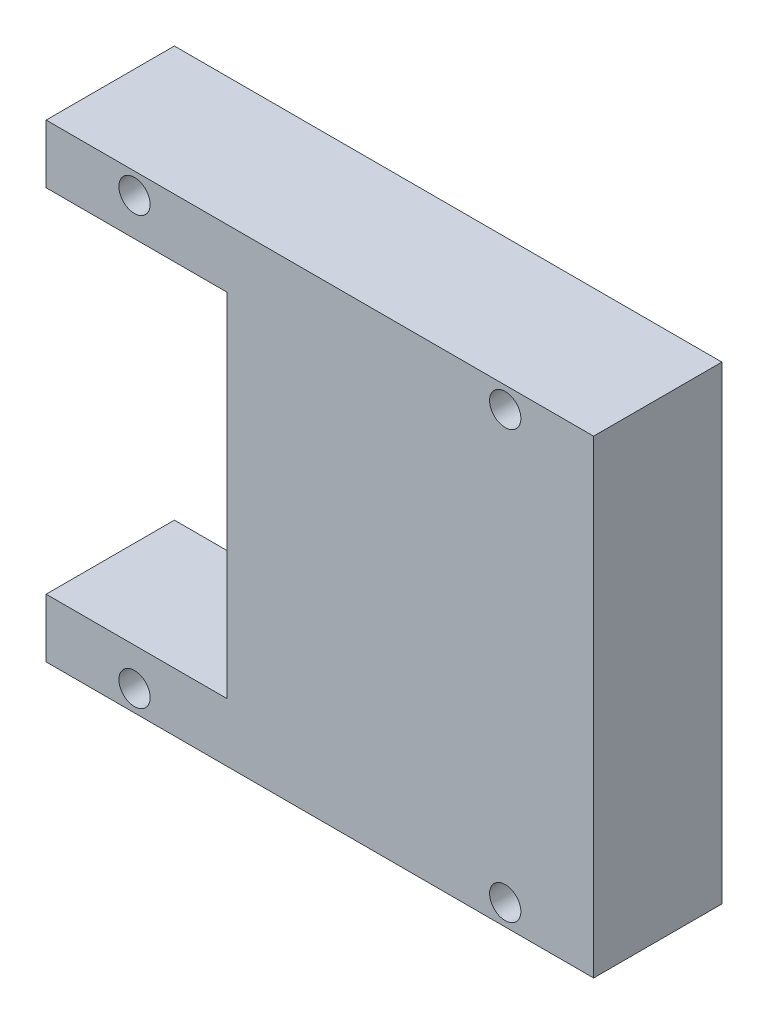
ISO-10303-21;
HEADER;
FILE_DESCRIPTION(('STEP AP214'),'2;1');
FILE_NAME('part.step','',(''),(''),'','','');
FILE_SCHEMA(('AUTOMOTIVE_DESIGN { 1 0 10303 214 1 1 1 1 }'));
ENDSEC;
DATA;
#1=APPLICATION_CONTEXT('core data for automotive mechanical design processes');
#2=APPLICATION_PROTOCOL_DEFINITION('international standard','automotive_design',2000,#1);
#3=PRODUCT_CONTEXT('',#1,'mechanical');
#4=PRODUCT('Part','Part','',(#3));
#5=PRODUCT_RELATED_PRODUCT_CATEGORY('part','',(#4));
#6=PRODUCT_DEFINITION_FORMATION('','',#4);
#7=PRODUCT_DEFINITION_CONTEXT('part definition',#1,'design');
#8=PRODUCT_DEFINITION('design','',#6,#7);
#9=PRODUCT_DEFINITION_SHAPE('','',#8);
#10=(LENGTH_UNIT() NAMED_UNIT(*) SI_UNIT(.MILLI.,.METRE.));
#11=(NAMED_UNIT(*) PLANE_ANGLE_UNIT() SI_UNIT($,.RADIAN.));
#12=(NAMED_UNIT(*) SI_UNIT($,.STERADIAN.) SOLID_ANGLE_UNIT());
#13=UNCERTAINTY_MEASURE_WITH_UNIT(LENGTH_MEASURE(1.E-05),#10,'distance_accuracy_value','');
#14=(GEOMETRIC_REPRESENTATION_CONTEXT(3) GLOBAL_UNCERTAINTY_ASSIGNED_CONTEXT((#13)) GLOBAL_UNIT_ASSIGNED_CONTEXT((#10,
#11,#12)) REPRESENTATION_CONTEXT('',''));
#15=CARTESIAN_POINT('',(0.,0.,0.));
#16=DIRECTION('',(0.,0.,1.));
#17=DIRECTION('',(1.,0.,0.));
#18=AXIS2_PLACEMENT_3D('',#15,#16,#17);
#19=CARTESIAN_POINT('',(0.,0.,8.2));
#20=DIRECTION('',(0.,0.,1.));
#21=DIRECTION('',(1.,0.,0.));
#22=AXIS2_PLACEMENT_3D('',#19,#20,#21);
#23=PLANE('',#22);
#24=CARTESIAN_POINT('',(-127.199999999977,13.6500000000247,8.2));
#25=DIRECTION('',(0.,0.,1.));
#26=DIRECTION('',(-1.,0.,0.));
#27=AXIS2_PLACEMENT_3D('',#24,#25,#26);
#28=CIRCLE('',#27,0.999999999999998);
#29=CARTESIAN_POINT('',(-128.199999999977,13.6500000000247,8.2));
#30=VERTEX_POINT('',#29);
#31=EDGE_CURVE('E190',#30,#30,#28,.T.);
#32=ORIENTED_EDGE('',*,*,#31,.F.);
#33=EDGE_LOOP('',(#32));
#34=FACE_BOUND('',#33,.T.);
#35=CARTESIAN_POINT('',(-150.899999999977,13.6500000000247,8.2));
#36=DIRECTION('',(0.,0.,1.));
#37=DIRECTION('',(1.,0.,0.));
#38=AXIS2_PLACEMENT_3D('',#35,#36,#37);
#39=CIRCLE('',#38,0.999999999999998);
#40=CARTESIAN_POINT('',(-149.899999999977,13.6500000000247,8.2));
#41=VERTEX_POINT('',#40);
#42=EDGE_CURVE('E136',#41,#41,#39,.T.);
#43=ORIENTED_EDGE('',*,*,#42,.F.);
#44=EDGE_LOOP('',(#43));
#45=FACE_BOUND('',#44,.T.);
#46=DIRECTION('',(0.,1.,0.));
#47=VECTOR('',#46,1.);
#48=CARTESIAN_POINT('',(-121.549999999977,-14.9999999999818,8.2));
#49=LINE('',#48,#47);
#50=CARTESIAN_POINT('',(-121.549999999977,-14.9999999999818,8.2));
#51=VERTEX_POINT('',#50);
#52=CARTESIAN_POINT('',(-121.549999999977,15.0000000000182,8.2));
#53=VERTEX_POINT('',#52);
#54=EDGE_CURVE('E147',#51,#53,#49,.T.);
#55=ORIENTED_EDGE('',*,*,#54,.T.);
#56=DIRECTION('',(-1.,0.,0.));
#57=VECTOR('',#56,1.);
#58=CARTESIAN_POINT('',(-121.549999999977,15.0000000000182,8.2));
#59=LINE('',#58,#57);
#60=CARTESIAN_POINT('',(-156.549999999977,15.0000000000182,8.2));
#61=VERTEX_POINT('',#60);
#62=EDGE_CURVE('E95',#53,#61,#59,.T.);
#63=ORIENTED_EDGE('',*,*,#62,.T.);
#64=DIRECTION('',(0.,-1.,0.));
#65=VECTOR('',#64,1.);
#66=CARTESIAN_POINT('',(-156.549999999977,11.2500000000239,8.2));
#67=LINE('',#66,#65);
#68=CARTESIAN_POINT('',(-156.549999999977,11.2500000000239,8.2));
#69=VERTEX_POINT('',#68);
#70=EDGE_CURVE('E162',#61,#69,#67,.T.);
#71=ORIENTED_EDGE('',*,*,#70,.T.);
#72=DIRECTION('',(1.,0.,0.));
#73=VECTOR('',#72,1.);
#74=CARTESIAN_POINT('',(-144.999999999982,11.2500000000239,8.2));
#75=LINE('',#74,#73);
#76=CARTESIAN_POINT('',(-144.999999999982,11.2500000000239,8.2));
#77=VERTEX_POINT('',#76);
#78=EDGE_CURVE('E175',#69,#77,#75,.T.);
#79=ORIENTED_EDGE('',*,*,#78,.T.);
#80=DIRECTION('',(0.,-1.,0.));
#81=VECTOR('',#80,1.);
#82=CARTESIAN_POINT('',(-144.999999999982,-11.2499999999762,8.2));
#83=LINE('',#82,#81);
#84=CARTESIAN_POINT('',(-144.999999999982,-11.2499999999762,8.2));
#85=VERTEX_POINT('',#84);
#86=EDGE_CURVE('E114',#77,#85,#83,.T.);
#87=ORIENTED_EDGE('',*,*,#86,.T.);
#88=DIRECTION('',(-1.,0.,0.));
#89=VECTOR('',#88,1.);
#90=CARTESIAN_POINT('',(-144.999999999982,-11.2499999999762,8.2));
#91=LINE('',#90,#89);
#92=CARTESIAN_POINT('',(-156.549999999977,-11.2499999999762,8.2));
#93=VERTEX_POINT('',#92);
#94=EDGE_CURVE('E108',#85,#93,#91,.T.);
#95=ORIENTED_EDGE('',*,*,#94,.T.);
#96=DIRECTION('',(0.,-1.,0.));
#97=VECTOR('',#96,1.);
#98=CARTESIAN_POINT('',(-156.549999999977,-14.9999999999818,8.2));
#99=LINE('',#98,#97);
#100=CARTESIAN_POINT('',(-156.549999999977,-14.9999999999818,8.2));
#101=VERTEX_POINT('',#100);
#102=EDGE_CURVE('E112',#93,#101,#99,.T.);
#103=ORIENTED_EDGE('',*,*,#102,.T.);
#104=DIRECTION('',(1.,0.,0.));
#105=VECTOR('',#104,1.);
#106=CARTESIAN_POINT('',(-121.549999999977,-14.9999999999818,8.2));
#107=LINE('',#106,#105);
#108=EDGE_CURVE('E52',#101,#51,#107,.T.);
#109=ORIENTED_EDGE('',*,*,#108,.T.);
#110=EDGE_LOOP('',(#55,#63,#71,#79,#87,#95,#103,#109));
#111=FACE_BOUND('',#110,.T.);
#112=CARTESIAN_POINT('',(-150.899999999977,-13.6499999999753,8.2));
#113=DIRECTION('',(0.,0.,1.));
#114=DIRECTION('',(1.,0.,0.));
#115=AXIS2_PLACEMENT_3D('',#112,#113,#114);
#116=CIRCLE('',#115,0.999999999999998);
#117=CARTESIAN_POINT('',(-149.899999999977,-13.6499999999753,8.2));
#118=VERTEX_POINT('',#117);
#119=EDGE_CURVE('E184',#118,#118,#116,.T.);
#120=ORIENTED_EDGE('',*,*,#119,.F.);
#121=EDGE_LOOP('',(#120));
#122=FACE_BOUND('',#121,.T.);
#123=CARTESIAN_POINT('',(-127.199999999977,-13.6499999999753,8.2));
#124=DIRECTION('',(0.,0.,1.));
#125=DIRECTION('',(-1.,0.,0.));
#126=AXIS2_PLACEMENT_3D('',#123,#124,#125);
#127=CIRCLE('',#126,0.999999999999998);
#128=CARTESIAN_POINT('',(-128.199999999977,-13.6499999999753,8.2));
#129=VERTEX_POINT('',#128);
#130=EDGE_CURVE('E196',#129,#129,#127,.T.);
#131=ORIENTED_EDGE('',*,*,#130,.F.);
#132=EDGE_LOOP('',(#131));
#133=FACE_BOUND('',#132,.T.);
#134=ADVANCED_FACE('F35',(#34,#45,#111,#122,#133),#23,.T.);
#135=CARTESIAN_POINT('',(0.,0.,0.));
#136=DIRECTION('',(0.,0.,1.));
#137=DIRECTION('',(1.,0.,0.));
#138=AXIS2_PLACEMENT_3D('',#135,#136,#137);
#139=PLANE('',#138);
#140=DIRECTION('',(0.,1.,0.));
#141=VECTOR('',#140,1.);
#142=CARTESIAN_POINT('',(-121.549999999977,-14.9999999999818,0.));
#143=LINE('',#142,#141);
#144=CARTESIAN_POINT('',(-121.549999999977,-14.9999999999818,0.));
#145=VERTEX_POINT('',#144);
#146=CARTESIAN_POINT('',(-121.549999999977,15.0000000000182,0.));
#147=VERTEX_POINT('',#146);
#148=EDGE_CURVE('E132',#145,#147,#143,.T.);
#149=ORIENTED_EDGE('',*,*,#148,.F.);
#150=DIRECTION('',(1.,0.,0.));
#151=VECTOR('',#150,1.);
#152=CARTESIAN_POINT('',(-121.549999999977,-14.9999999999818,0.));
#153=LINE('',#152,#151);
#154=CARTESIAN_POINT('',(-156.549999999977,-14.9999999999818,0.));
#155=VERTEX_POINT('',#154);
#156=EDGE_CURVE('E87',#155,#145,#153,.T.);
#157=ORIENTED_EDGE('',*,*,#156,.F.);
#158=DIRECTION('',(0.,-1.,0.));
#159=VECTOR('',#158,1.);
#160=CARTESIAN_POINT('',(-156.549999999977,-14.9999999999818,0.));
#161=LINE('',#160,#159);
#162=CARTESIAN_POINT('',(-156.549999999977,-11.2499999999762,0.));
#163=VERTEX_POINT('',#162);
#164=EDGE_CURVE('E81',#163,#155,#161,.T.);
#165=ORIENTED_EDGE('',*,*,#164,.F.);
#166=DIRECTION('',(-1.,0.,0.));
#167=VECTOR('',#166,1.);
#168=CARTESIAN_POINT('',(-144.999999999982,-11.2499999999762,0.));
#169=LINE('',#168,#167);
#170=CARTESIAN_POINT('',(-144.999999999982,-11.2499999999762,0.));
#171=VERTEX_POINT('',#170);
#172=EDGE_CURVE('E122',#171,#163,#169,.T.);
#173=ORIENTED_EDGE('',*,*,#172,.F.);
#174=DIRECTION('',(0.,-1.,0.));
#175=VECTOR('',#174,1.);
#176=CARTESIAN_POINT('',(-144.999999999982,-11.2499999999762,0.));
#177=LINE('',#176,#175);
#178=CARTESIAN_POINT('',(-144.999999999982,11.2500000000239,0.));
#179=VERTEX_POINT('',#178);
#180=EDGE_CURVE('E142',#179,#171,#177,.T.);
#181=ORIENTED_EDGE('',*,*,#180,.F.);
#182=DIRECTION('',(1.,0.,0.));
#183=VECTOR('',#182,1.);
#184=CARTESIAN_POINT('',(-144.999999999982,11.2500000000239,0.));
#185=LINE('',#184,#183);
#186=CARTESIAN_POINT('',(-156.549999999977,11.2500000000239,0.));
#187=VERTEX_POINT('',#186);
#188=EDGE_CURVE('E140',#187,#179,#185,.T.);
#189=ORIENTED_EDGE('',*,*,#188,.F.);
#190=DIRECTION('',(0.,-1.,0.));
#191=VECTOR('',#190,1.);
#192=CARTESIAN_POINT('',(-156.549999999977,11.2500000000239,0.));
#193=LINE('',#192,#191);
#194=CARTESIAN_POINT('',(-156.549999999977,15.0000000000182,0.));
#195=VERTEX_POINT('',#194);
#196=EDGE_CURVE('E138',#195,#187,#193,.T.);
#197=ORIENTED_EDGE('',*,*,#196,.F.);
#198=DIRECTION('',(-1.,0.,0.));
#199=VECTOR('',#198,1.);
#200=CARTESIAN_POINT('',(-121.549999999977,15.0000000000182,0.));
#201=LINE('',#200,#199);
#202=EDGE_CURVE('E135',#147,#195,#201,.T.);
#203=ORIENTED_EDGE('',*,*,#202,.F.);
#204=EDGE_LOOP('',(#149,#157,#165,#173,#181,#189,#197,#203));
#205=FACE_BOUND('',#204,.T.);
#206=CARTESIAN_POINT('',(-150.899999999977,13.6500000000247,0.));
#207=DIRECTION('',(0.,0.,1.));
#208=DIRECTION('',(1.,0.,0.));
#209=AXIS2_PLACEMENT_3D('',#206,#207,#208);
#210=CIRCLE('',#209,0.999999999999998);
#211=CARTESIAN_POINT('',(-149.899999999977,13.6500000000247,0.));
#212=VERTEX_POINT('',#211);
#213=EDGE_CURVE('E181',#212,#212,#210,.T.);
#214=ORIENTED_EDGE('',*,*,#213,.T.);
#215=EDGE_LOOP('',(#214));
#216=FACE_BOUND('',#215,.T.);
#217=CARTESIAN_POINT('',(-150.899999999977,-13.6499999999753,0.));
#218=DIRECTION('',(0.,0.,1.));
#219=DIRECTION('',(1.,0.,0.));
#220=AXIS2_PLACEMENT_3D('',#217,#218,#219);
#221=CIRCLE('',#220,0.999999999999998);
#222=CARTESIAN_POINT('',(-149.899999999977,-13.6499999999753,0.));
#223=VERTEX_POINT('',#222);
#224=EDGE_CURVE('E187',#223,#223,#221,.T.);
#225=ORIENTED_EDGE('',*,*,#224,.T.);
#226=EDGE_LOOP('',(#225));
#227=FACE_BOUND('',#226,.T.);
#228=CARTESIAN_POINT('',(-127.199999999977,13.6500000000247,0.));
#229=DIRECTION('',(0.,0.,1.));
#230=DIRECTION('',(-1.,0.,0.));
#231=AXIS2_PLACEMENT_3D('',#228,#229,#230);
#232=CIRCLE('',#231,0.999999999999998);
#233=CARTESIAN_POINT('',(-128.199999999977,13.6500000000247,0.));
#234=VERTEX_POINT('',#233);
#235=EDGE_CURVE('E193',#234,#234,#232,.T.);
#236=ORIENTED_EDGE('',*,*,#235,.T.);
#237=EDGE_LOOP('',(#236));
#238=FACE_BOUND('',#237,.T.);
#239=CARTESIAN_POINT('',(-127.199999999977,-13.6499999999753,0.));
#240=DIRECTION('',(0.,0.,1.));
#241=DIRECTION('',(-1.,0.,0.));
#242=AXIS2_PLACEMENT_3D('',#239,#240,#241);
#243=CIRCLE('',#242,0.999999999999998);
#244=CARTESIAN_POINT('',(-128.199999999977,-13.6499999999753,0.));
#245=VERTEX_POINT('',#244);
#246=EDGE_CURVE('E199',#245,#245,#243,.T.);
#247=ORIENTED_EDGE('',*,*,#246,.T.);
#248=EDGE_LOOP('',(#247));
#249=FACE_BOUND('',#248,.T.);
#250=ADVANCED_FACE('F166',(#205,#216,#227,#238,#249),#139,.F.);
#251=CARTESIAN_POINT('',(-121.549999999977,-14.9999999999818,8.2));
#252=DIRECTION('',(-1.,0.,0.));
#253=DIRECTION('',(0.,0.,1.));
#254=AXIS2_PLACEMENT_3D('',#251,#252,#253);
#255=PLANE('',#254);
#256=ORIENTED_EDGE('',*,*,#148,.T.);
#257=DIRECTION('',(0.,0.,-1.));
#258=VECTOR('',#257,1.);
#259=CARTESIAN_POINT('',(-121.549999999977,15.0000000000182,8.2));
#260=LINE('',#259,#258);
#261=EDGE_CURVE('E11',#53,#147,#260,.T.);
#262=ORIENTED_EDGE('',*,*,#261,.F.);
#263=ORIENTED_EDGE('',*,*,#54,.F.);
#264=DIRECTION('',(0.,0.,-1.));
#265=VECTOR('',#264,1.);
#266=CARTESIAN_POINT('',(-121.549999999977,-14.9999999999818,8.2));
#267=LINE('',#266,#265);
#268=EDGE_CURVE('E128',#51,#145,#267,.T.);
#269=ORIENTED_EDGE('',*,*,#268,.T.);
#270=EDGE_LOOP('',(#256,#262,#263,#269));
#271=FACE_BOUND('',#270,.T.);
#272=ADVANCED_FACE('F37',(#271),#255,.F.);
#273=CARTESIAN_POINT('',(-121.549999999977,15.0000000000182,8.2));
#274=DIRECTION('',(0.,-1.,0.));
#275=DIRECTION('',(0.,0.,-1.));
#276=AXIS2_PLACEMENT_3D('',#273,#274,#275);
#277=PLANE('',#276);
#278=ORIENTED_EDGE('',*,*,#202,.T.);
#279=DIRECTION('',(0.,0.,-1.));
#280=VECTOR('',#279,1.);
#281=CARTESIAN_POINT('',(-156.549999999977,15.0000000000182,8.2));
#282=LINE('',#281,#280);
#283=EDGE_CURVE('E44',#61,#195,#282,.T.);
#284=ORIENTED_EDGE('',*,*,#283,.F.);
#285=ORIENTED_EDGE('',*,*,#62,.F.);
#286=ORIENTED_EDGE('',*,*,#261,.T.);
#287=EDGE_LOOP('',(#278,#284,#285,#286));
#288=FACE_BOUND('',#287,.T.);
#289=ADVANCED_FACE('F233',(#288),#277,.F.);
#290=CARTESIAN_POINT('',(-156.549999999977,11.2500000000239,8.2));
#291=DIRECTION('',(1.,0.,0.));
#292=DIRECTION('',(0.,0.,-1.));
#293=AXIS2_PLACEMENT_3D('',#290,#291,#292);
#294=PLANE('',#293);
#295=ORIENTED_EDGE('',*,*,#196,.T.);
#296=DIRECTION('',(0.,0.,-1.));
#297=VECTOR('',#296,1.);
#298=CARTESIAN_POINT('',(-156.549999999977,11.2500000000239,8.2));
#299=LINE('',#298,#297);
#300=EDGE_CURVE('E154',#69,#187,#299,.T.);
#301=ORIENTED_EDGE('',*,*,#300,.F.);
#302=ORIENTED_EDGE('',*,*,#70,.F.);
#303=ORIENTED_EDGE('',*,*,#283,.T.);
#304=EDGE_LOOP('',(#295,#301,#302,#303));
#305=FACE_BOUND('',#304,.T.);
#306=ADVANCED_FACE('F160',(#305),#294,.F.);
#307=CARTESIAN_POINT('',(-144.999999999982,11.2500000000239,8.2));
#308=DIRECTION('',(0.,1.,0.));
#309=DIRECTION('',(-1.,0.,0.));
#310=AXIS2_PLACEMENT_3D('',#307,#308,#309);
#311=PLANE('',#310);
#312=ORIENTED_EDGE('',*,*,#188,.T.);
#313=DIRECTION('',(0.,0.,-1.));
#314=VECTOR('',#313,1.);
#315=CARTESIAN_POINT('',(-144.999999999982,11.2500000000239,8.2));
#316=LINE('',#315,#314);
#317=EDGE_CURVE('E151',#77,#179,#316,.T.);
#318=ORIENTED_EDGE('',*,*,#317,.F.);
#319=ORIENTED_EDGE('',*,*,#78,.F.);
#320=ORIENTED_EDGE('',*,*,#300,.T.);
#321=EDGE_LOOP('',(#312,#318,#319,#320));
#322=FACE_BOUND('',#321,.T.);
#323=ADVANCED_FACE('F171',(#322),#311,.F.);
#324=CARTESIAN_POINT('',(-144.999999999982,-11.2499999999762,8.2));
#325=DIRECTION('',(1.,0.,0.));
#326=DIRECTION('',(0.,0.,-1.));
#327=AXIS2_PLACEMENT_3D('',#324,#325,#326);
#328=PLANE('',#327);
#329=ORIENTED_EDGE('',*,*,#180,.T.);
#330=DIRECTION('',(0.,0.,-1.));
#331=VECTOR('',#330,1.);
#332=CARTESIAN_POINT('',(-144.999999999982,-11.2499999999762,8.2));
#333=LINE('',#332,#331);
#334=EDGE_CURVE('E123',#85,#171,#333,.T.);
#335=ORIENTED_EDGE('',*,*,#334,.F.);
#336=ORIENTED_EDGE('',*,*,#86,.F.);
#337=ORIENTED_EDGE('',*,*,#317,.T.);
#338=EDGE_LOOP('',(#329,#335,#336,#337));
#339=FACE_BOUND('',#338,.T.);
#340=ADVANCED_FACE('F174',(#339),#328,.F.);
#341=CARTESIAN_POINT('',(-144.999999999982,-11.2499999999762,8.2));
#342=DIRECTION('',(0.,-1.,0.));
#343=DIRECTION('',(1.,0.,0.));
#344=AXIS2_PLACEMENT_3D('',#341,#342,#343);
#345=PLANE('',#344);
#346=ORIENTED_EDGE('',*,*,#172,.T.);
#347=DIRECTION('',(0.,0.,-1.));
#348=VECTOR('',#347,1.);
#349=CARTESIAN_POINT('',(-156.549999999977,-11.2499999999762,8.2));
#350=LINE('',#349,#348);
#351=EDGE_CURVE('E119',#93,#163,#350,.T.);
#352=ORIENTED_EDGE('',*,*,#351,.F.);
#353=ORIENTED_EDGE('',*,*,#94,.F.);
#354=ORIENTED_EDGE('',*,*,#334,.T.);
#355=EDGE_LOOP('',(#346,#352,#353,#354));
#356=FACE_BOUND('',#355,.T.);
#357=ADVANCED_FACE('F120',(#356),#345,.F.);
#358=CARTESIAN_POINT('',(-156.549999999977,-14.9999999999818,8.2));
#359=DIRECTION('',(1.,0.,0.));
#360=DIRECTION('',(0.,0.,-1.));
#361=AXIS2_PLACEMENT_3D('',#358,#359,#360);
#362=PLANE('',#361);
#363=ORIENTED_EDGE('',*,*,#164,.T.);
#364=DIRECTION('',(0.,0.,-1.));
#365=VECTOR('',#364,1.);
#366=CARTESIAN_POINT('',(-156.549999999977,-14.9999999999818,8.2));
#367=LINE('',#366,#365);
#368=EDGE_CURVE('E124',#101,#155,#367,.T.);
#369=ORIENTED_EDGE('',*,*,#368,.F.);
#370=ORIENTED_EDGE('',*,*,#102,.F.);
#371=ORIENTED_EDGE('',*,*,#351,.T.);
#372=EDGE_LOOP('',(#363,#369,#370,#371));
#373=FACE_BOUND('',#372,.T.);
#374=ADVANCED_FACE('F126',(#373),#362,.F.);
#375=CARTESIAN_POINT('',(-121.549999999977,-14.9999999999818,8.2));
#376=DIRECTION('',(0.,1.,0.));
#377=DIRECTION('',(0.,0.,1.));
#378=AXIS2_PLACEMENT_3D('',#375,#376,#377);
#379=PLANE('',#378);
#380=ORIENTED_EDGE('',*,*,#156,.T.);
#381=ORIENTED_EDGE('',*,*,#268,.F.);
#382=ORIENTED_EDGE('',*,*,#108,.F.);
#383=ORIENTED_EDGE('',*,*,#368,.T.);
#384=EDGE_LOOP('',(#380,#381,#382,#383));
#385=FACE_BOUND('',#384,.T.);
#386=ADVANCED_FACE('F221',(#385),#379,.F.);
#387=CARTESIAN_POINT('',(-150.899999999977,13.6500000000247,8.2));
#388=DIRECTION('',(0.,0.,-1.));
#389=DIRECTION('',(-1.,0.,0.));
#390=AXIS2_PLACEMENT_3D('',#387,#388,#389);
#391=CYLINDRICAL_SURFACE('',#390,0.999999999999998);
#392=ORIENTED_EDGE('',*,*,#42,.T.);
#393=EDGE_LOOP('',(#392));
#394=FACE_BOUND('',#393,.T.);
#395=ORIENTED_EDGE('',*,*,#213,.F.);
#396=EDGE_LOOP('',(#395));
#397=FACE_BOUND('',#396,.T.);
#398=ADVANCED_FACE('F218',(#394,#397),#391,.F.);
#399=CARTESIAN_POINT('',(-150.899999999977,-13.6499999999753,8.2));
#400=DIRECTION('',(0.,0.,-1.));
#401=DIRECTION('',(-1.,0.,0.));
#402=AXIS2_PLACEMENT_3D('',#399,#400,#401);
#403=CYLINDRICAL_SURFACE('',#402,0.999999999999998);
#404=ORIENTED_EDGE('',*,*,#119,.T.);
#405=EDGE_LOOP('',(#404));
#406=FACE_BOUND('',#405,.T.);
#407=ORIENTED_EDGE('',*,*,#224,.F.);
#408=EDGE_LOOP('',(#407));
#409=FACE_BOUND('',#408,.T.);
#410=ADVANCED_FACE('F297',(#406,#409),#403,.F.);
#411=CARTESIAN_POINT('',(-127.199999999977,13.6500000000247,8.2));
#412=DIRECTION('',(0.,0.,-1.));
#413=DIRECTION('',(-1.,0.,0.));
#414=AXIS2_PLACEMENT_3D('',#411,#412,#413);
#415=CYLINDRICAL_SURFACE('',#414,0.999999999999998);
#416=ORIENTED_EDGE('',*,*,#31,.T.);
#417=EDGE_LOOP('',(#416));
#418=FACE_BOUND('',#417,.T.);
#419=ORIENTED_EDGE('',*,*,#235,.F.);
#420=EDGE_LOOP('',(#419));
#421=FACE_BOUND('',#420,.T.);
#422=ADVANCED_FACE('F305',(#418,#421),#415,.F.);
#423=CARTESIAN_POINT('',(-127.199999999977,-13.6499999999753,8.2));
#424=DIRECTION('',(0.,0.,-1.));
#425=DIRECTION('',(-1.,0.,0.));
#426=AXIS2_PLACEMENT_3D('',#423,#424,#425);
#427=CYLINDRICAL_SURFACE('',#426,0.999999999999998);
#428=ORIENTED_EDGE('',*,*,#130,.T.);
#429=EDGE_LOOP('',(#428));
#430=FACE_BOUND('',#429,.T.);
#431=ORIENTED_EDGE('',*,*,#246,.F.);
#432=EDGE_LOOP('',(#431));
#433=FACE_BOUND('',#432,.T.);
#434=ADVANCED_FACE('F205',(#430,#433),#427,.F.);
#435=CLOSED_SHELL('',(#134,#250,#272,#289,#306,#323,#340,#357,#374,#386,#398,#410,#422,#434));
#436=MANIFOLD_SOLID_BREP('B2',#435);
#437=ADVANCED_BREP_SHAPE_REPRESENTATION('',(#18,#436),#14);
#438=SHAPE_DEFINITION_REPRESENTATION(#9,#437);
ENDSEC;
END-ISO-10303-21;
